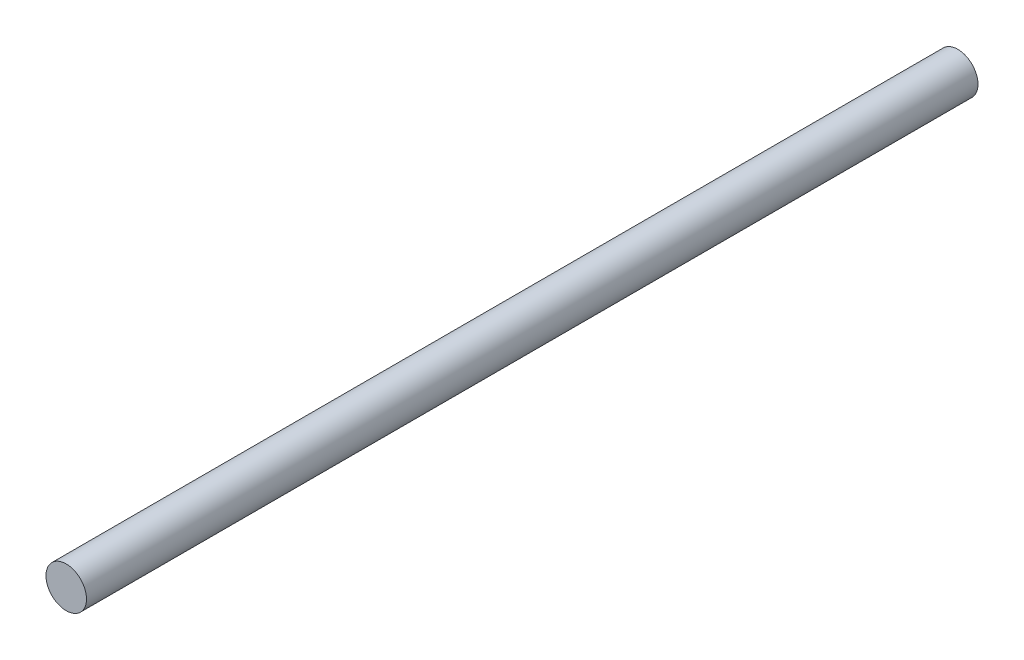
ISO-10303-21;
HEADER;
FILE_DESCRIPTION(('STEP AP214'),'2;1');
FILE_NAME('part.step','',(''),(''),'','','');
FILE_SCHEMA(('AUTOMOTIVE_DESIGN { 1 0 10303 214 1 1 1 1 }'));
ENDSEC;
DATA;
#1=APPLICATION_CONTEXT('core data for automotive mechanical design processes');
#2=APPLICATION_PROTOCOL_DEFINITION('international standard','automotive_design',2000,#1);
#3=PRODUCT_CONTEXT('',#1,'mechanical');
#4=PRODUCT('Part','Part','',(#3));
#5=PRODUCT_RELATED_PRODUCT_CATEGORY('part','',(#4));
#6=PRODUCT_DEFINITION_FORMATION('','',#4);
#7=PRODUCT_DEFINITION_CONTEXT('part definition',#1,'design');
#8=PRODUCT_DEFINITION('design','',#6,#7);
#9=PRODUCT_DEFINITION_SHAPE('','',#8);
#10=(LENGTH_UNIT() NAMED_UNIT(*) SI_UNIT(.MILLI.,.METRE.));
#11=(NAMED_UNIT(*) PLANE_ANGLE_UNIT() SI_UNIT($,.RADIAN.));
#12=(NAMED_UNIT(*) SI_UNIT($,.STERADIAN.) SOLID_ANGLE_UNIT());
#13=UNCERTAINTY_MEASURE_WITH_UNIT(LENGTH_MEASURE(1.E-05),#10,'distance_accuracy_value','');
#14=(GEOMETRIC_REPRESENTATION_CONTEXT(3) GLOBAL_UNCERTAINTY_ASSIGNED_CONTEXT((#13)) GLOBAL_UNIT_ASSIGNED_CONTEXT((#10,
#11,#12)) REPRESENTATION_CONTEXT('',''));
#15=CARTESIAN_POINT('',(0.,0.,0.));
#16=DIRECTION('',(0.,0.,1.));
#17=DIRECTION('',(1.,0.,0.));
#18=AXIS2_PLACEMENT_3D('',#15,#16,#17);
#19=CARTESIAN_POINT('',(0.,0.,176.));
#20=DIRECTION('',(0.,0.,-1.));
#21=DIRECTION('',(-1.,0.,0.));
#22=AXIS2_PLACEMENT_3D('',#19,#20,#21);
#23=CYLINDRICAL_SURFACE('',#22,4.);
#24=CARTESIAN_POINT('',(0.,0.,176.));
#25=DIRECTION('',(0.,0.,1.));
#26=DIRECTION('',(1.,0.,0.));
#27=AXIS2_PLACEMENT_3D('',#24,#25,#26);
#28=CIRCLE('',#27,4.);
#29=CARTESIAN_POINT('',(4.,0.,176.));
#30=VERTEX_POINT('',#29);
#31=EDGE_CURVE('E10',#30,#30,#28,.T.);
#32=ORIENTED_EDGE('',*,*,#31,.F.);
#33=EDGE_LOOP('',(#32));
#34=FACE_BOUND('',#33,.T.);
#35=CARTESIAN_POINT('',(0.,0.,0.));
#36=DIRECTION('',(0.,0.,1.));
#37=DIRECTION('',(1.,0.,0.));
#38=AXIS2_PLACEMENT_3D('',#35,#36,#37);
#39=CIRCLE('',#38,4.);
#40=CARTESIAN_POINT('',(4.,0.,0.));
#41=VERTEX_POINT('',#40);
#42=EDGE_CURVE('E34',#41,#41,#39,.T.);
#43=ORIENTED_EDGE('',*,*,#42,.T.);
#44=EDGE_LOOP('',(#43));
#45=FACE_BOUND('',#44,.T.);
#46=ADVANCED_FACE('F31',(#34,#45),#23,.T.);
#47=CARTESIAN_POINT('',(0.,0.,176.));
#48=DIRECTION('',(0.,0.,1.));
#49=DIRECTION('',(1.,0.,0.));
#50=AXIS2_PLACEMENT_3D('',#47,#48,#49);
#51=PLANE('',#50);
#52=ORIENTED_EDGE('',*,*,#31,.T.);
#53=EDGE_LOOP('',(#52));
#54=FACE_BOUND('',#53,.T.);
#55=ADVANCED_FACE('F46',(#54),#51,.T.);
#56=CARTESIAN_POINT('',(0.,0.,0.));
#57=DIRECTION('',(0.,0.,1.));
#58=DIRECTION('',(1.,0.,0.));
#59=AXIS2_PLACEMENT_3D('',#56,#57,#58);
#60=PLANE('',#59);
#61=ORIENTED_EDGE('',*,*,#42,.F.);
#62=EDGE_LOOP('',(#61));
#63=FACE_BOUND('',#62,.T.);
#64=ADVANCED_FACE('F44',(#63),#60,.F.);
#65=CLOSED_SHELL('',(#46,#55,#64));
#66=MANIFOLD_SOLID_BREP('B2',#65);
#67=ADVANCED_BREP_SHAPE_REPRESENTATION('',(#18,#66),#14);
#68=SHAPE_DEFINITION_REPRESENTATION(#9,#67);
ENDSEC;
END-ISO-10303-21;
